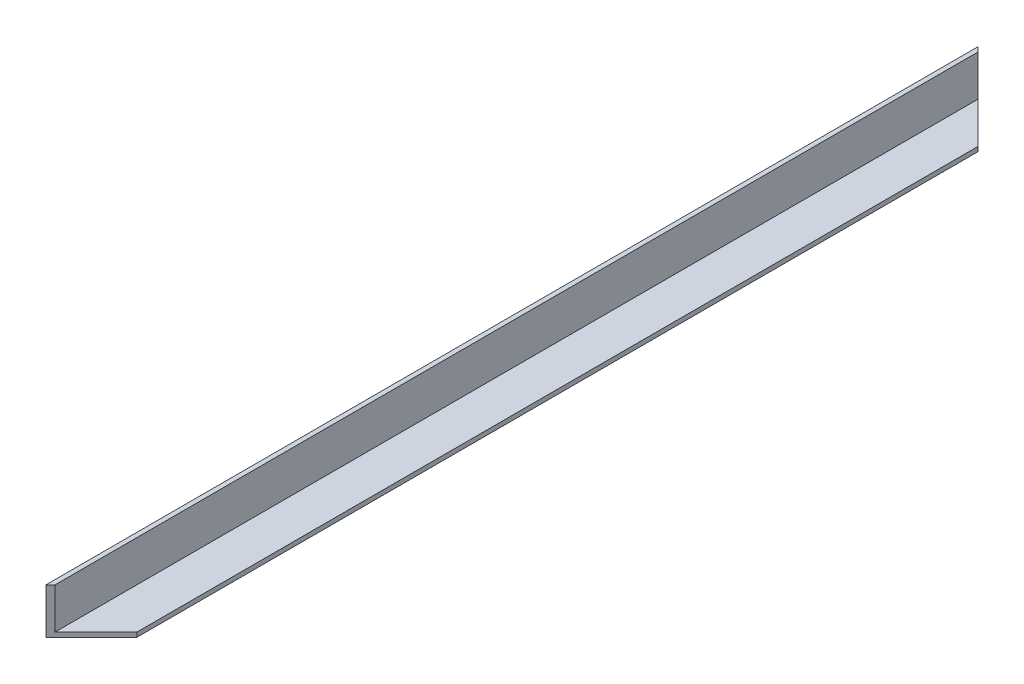
ISO-10303-21;
HEADER;
FILE_DESCRIPTION(('STEP AP214'),'2;1');
FILE_NAME('part.step','',(''),(''),'','','');
FILE_SCHEMA(('AUTOMOTIVE_DESIGN { 1 0 10303 214 1 1 1 1 }'));
ENDSEC;
DATA;
#1=APPLICATION_CONTEXT('core data for automotive mechanical design processes');
#2=APPLICATION_PROTOCOL_DEFINITION('international standard','automotive_design',2000,#1);
#3=PRODUCT_CONTEXT('',#1,'mechanical');
#4=PRODUCT('Part','Part','',(#3));
#5=PRODUCT_RELATED_PRODUCT_CATEGORY('part','',(#4));
#6=PRODUCT_DEFINITION_FORMATION('','',#4);
#7=PRODUCT_DEFINITION_CONTEXT('part definition',#1,'design');
#8=PRODUCT_DEFINITION('design','',#6,#7);
#9=PRODUCT_DEFINITION_SHAPE('','',#8);
#10=(LENGTH_UNIT() NAMED_UNIT(*) SI_UNIT(.MILLI.,.METRE.));
#11=(NAMED_UNIT(*) PLANE_ANGLE_UNIT() SI_UNIT($,.RADIAN.));
#12=(NAMED_UNIT(*) SI_UNIT($,.STERADIAN.) SOLID_ANGLE_UNIT());
#13=UNCERTAINTY_MEASURE_WITH_UNIT(LENGTH_MEASURE(1.E-05),#10,'distance_accuracy_value','');
#14=(GEOMETRIC_REPRESENTATION_CONTEXT(3) GLOBAL_UNCERTAINTY_ASSIGNED_CONTEXT((#13)) GLOBAL_UNIT_ASSIGNED_CONTEXT((#10,
#11,#12)) REPRESENTATION_CONTEXT('',''));
#15=CARTESIAN_POINT('',(0.,0.,0.));
#16=DIRECTION('',(0.,0.,1.));
#17=DIRECTION('',(1.,0.,0.));
#18=AXIS2_PLACEMENT_3D('',#15,#16,#17);
#19=CARTESIAN_POINT('',(2.,20.,410.));
#20=DIRECTION('',(0.,-1.,0.));
#21=DIRECTION('',(0.,0.,-1.));
#22=AXIS2_PLACEMENT_3D('',#19,#20,#21);
#23=PLANE('',#22);
#24=DIRECTION('',(0.,0.,-1.));
#25=VECTOR('',#24,1.);
#26=CARTESIAN_POINT('',(2.,20.,410.));
#27=LINE('',#26,#25);
#28=CARTESIAN_POINT('',(2.,20.,408.));
#29=VERTEX_POINT('',#28);
#30=CARTESIAN_POINT('',(1.99999999999999,20.,1.99999999999995));
#31=VERTEX_POINT('',#30);
#32=EDGE_CURVE('E115',#29,#31,#27,.T.);
#33=ORIENTED_EDGE('',*,*,#32,.T.);
#34=DIRECTION('',(0.707106781186553,0.,0.707106781186542));
#35=VECTOR('',#34,1.);
#36=CARTESIAN_POINT('',(0.,20.,0.));
#37=LINE('',#36,#35);
#38=CARTESIAN_POINT('',(0.,20.,0.));
#39=VERTEX_POINT('',#38);
#40=EDGE_CURVE('E103',#39,#31,#37,.T.);
#41=ORIENTED_EDGE('',*,*,#40,.F.);
#42=DIRECTION('',(0.,0.,-1.));
#43=VECTOR('',#42,1.);
#44=CARTESIAN_POINT('',(0.,20.,410.));
#45=LINE('',#44,#43);
#46=CARTESIAN_POINT('',(0.,20.,410.));
#47=VERTEX_POINT('',#46);
#48=EDGE_CURVE('E11',#47,#39,#45,.T.);
#49=ORIENTED_EDGE('',*,*,#48,.F.);
#50=DIRECTION('',(-0.707106781186541,0.,0.707106781186554));
#51=VECTOR('',#50,1.);
#52=CARTESIAN_POINT('',(0.,20.,410.));
#53=LINE('',#52,#51);
#54=EDGE_CURVE('E50',#29,#47,#53,.T.);
#55=ORIENTED_EDGE('',*,*,#54,.F.);
#56=EDGE_LOOP('',(#33,#41,#49,#55));
#57=FACE_BOUND('',#56,.T.);
#58=ADVANCED_FACE('F36',(#57),#23,.F.);
#59=CARTESIAN_POINT('',(0.,20.,410.));
#60=DIRECTION('',(1.,0.,0.));
#61=DIRECTION('',(0.,1.,0.));
#62=AXIS2_PLACEMENT_3D('',#59,#60,#61);
#63=PLANE('',#62);
#64=DIRECTION('',(0.,-1.,0.));
#65=VECTOR('',#64,1.);
#66=CARTESIAN_POINT('',(0.,20.,0.));
#67=LINE('',#66,#65);
#68=CARTESIAN_POINT('',(0.,0.,0.));
#69=VERTEX_POINT('',#68);
#70=EDGE_CURVE('E119',#39,#69,#67,.T.);
#71=ORIENTED_EDGE('',*,*,#70,.T.);
#72=DIRECTION('',(0.,0.,-1.));
#73=VECTOR('',#72,1.);
#74=CARTESIAN_POINT('',(0.,0.,410.));
#75=LINE('',#74,#73);
#76=CARTESIAN_POINT('',(0.,0.,410.));
#77=VERTEX_POINT('',#76);
#78=EDGE_CURVE('E44',#77,#69,#75,.T.);
#79=ORIENTED_EDGE('',*,*,#78,.F.);
#80=DIRECTION('',(0.,-1.,0.));
#81=VECTOR('',#80,1.);
#82=CARTESIAN_POINT('',(0.,20.,410.));
#83=LINE('',#82,#81);
#84=EDGE_CURVE('E118',#47,#77,#83,.T.);
#85=ORIENTED_EDGE('',*,*,#84,.F.);
#86=ORIENTED_EDGE('',*,*,#48,.T.);
#87=EDGE_LOOP('',(#71,#79,#85,#86));
#88=FACE_BOUND('',#87,.T.);
#89=ADVANCED_FACE('F143',(#88),#63,.F.);
#90=CARTESIAN_POINT('',(0.,0.,410.));
#91=DIRECTION('',(0.,1.,0.));
#92=DIRECTION('',(0.,0.,1.));
#93=AXIS2_PLACEMENT_3D('',#90,#91,#92);
#94=PLANE('',#93);
#95=ORIENTED_EDGE('',*,*,#78,.T.);
#96=DIRECTION('',(0.707106781186553,0.,0.707106781186542));
#97=VECTOR('',#96,1.);
#98=CARTESIAN_POINT('',(0.,0.,0.));
#99=LINE('',#98,#97);
#100=CARTESIAN_POINT('',(20.,0.,19.9999999999997));
#101=VERTEX_POINT('',#100);
#102=EDGE_CURVE('E86',#69,#101,#99,.T.);
#103=ORIENTED_EDGE('',*,*,#102,.T.);
#104=DIRECTION('',(0.,0.,-1.));
#105=VECTOR('',#104,1.);
#106=CARTESIAN_POINT('',(20.,0.,410.));
#107=LINE('',#106,#105);
#108=CARTESIAN_POINT('',(20.,0.,390.));
#109=VERTEX_POINT('',#108);
#110=EDGE_CURVE('E101',#109,#101,#107,.T.);
#111=ORIENTED_EDGE('',*,*,#110,.F.);
#112=DIRECTION('',(-0.707106781186541,0.,0.707106781186554));
#113=VECTOR('',#112,1.);
#114=CARTESIAN_POINT('',(0.,0.,410.));
#115=LINE('',#114,#113);
#116=EDGE_CURVE('E131',#109,#77,#115,.T.);
#117=ORIENTED_EDGE('',*,*,#116,.T.);
#118=EDGE_LOOP('',(#95,#103,#111,#117));
#119=FACE_BOUND('',#118,.T.);
#120=ADVANCED_FACE('F99',(#119),#94,.F.);
#121=CARTESIAN_POINT('',(20.,0.,410.));
#122=DIRECTION('',(-1.,0.,0.));
#123=DIRECTION('',(0.,0.,1.));
#124=AXIS2_PLACEMENT_3D('',#121,#122,#123);
#125=PLANE('',#124);
#126=ORIENTED_EDGE('',*,*,#110,.T.);
#127=DIRECTION('',(0.,1.,0.));
#128=VECTOR('',#127,1.);
#129=CARTESIAN_POINT('',(20.,0.,19.9999999999997));
#130=LINE('',#129,#128);
#131=CARTESIAN_POINT('',(20.,2.,19.9999999999997));
#132=VERTEX_POINT('',#131);
#133=EDGE_CURVE('E83',#101,#132,#130,.T.);
#134=ORIENTED_EDGE('',*,*,#133,.T.);
#135=DIRECTION('',(0.,0.,-1.));
#136=VECTOR('',#135,1.);
#137=CARTESIAN_POINT('',(20.,2.,410.));
#138=LINE('',#137,#136);
#139=CARTESIAN_POINT('',(20.,2.,390.));
#140=VERTEX_POINT('',#139);
#141=EDGE_CURVE('E108',#140,#132,#138,.T.);
#142=ORIENTED_EDGE('',*,*,#141,.F.);
#143=DIRECTION('',(0.,1.,0.));
#144=VECTOR('',#143,1.);
#145=CARTESIAN_POINT('',(20.,0.,390.));
#146=LINE('',#145,#144);
#147=EDGE_CURVE('E107',#109,#140,#146,.T.);
#148=ORIENTED_EDGE('',*,*,#147,.F.);
#149=EDGE_LOOP('',(#126,#134,#142,#148));
#150=FACE_BOUND('',#149,.T.);
#151=ADVANCED_FACE('F106',(#150),#125,.F.);
#152=CARTESIAN_POINT('',(20.,2.,410.));
#153=DIRECTION('',(0.,-1.,0.));
#154=DIRECTION('',(1.,0.,0.));
#155=AXIS2_PLACEMENT_3D('',#152,#153,#154);
#156=PLANE('',#155);
#157=ORIENTED_EDGE('',*,*,#141,.T.);
#158=DIRECTION('',(-0.707106781186553,0.,-0.707106781186542));
#159=VECTOR('',#158,1.);
#160=CARTESIAN_POINT('',(215.,2.00000000000002,214.999999999997));
#161=LINE('',#160,#159);
#162=CARTESIAN_POINT('',(2.,2.,1.99999999999995));
#163=VERTEX_POINT('',#162);
#164=EDGE_CURVE('E89',#132,#163,#161,.T.);
#165=ORIENTED_EDGE('',*,*,#164,.T.);
#166=DIRECTION('',(0.,0.,-1.));
#167=VECTOR('',#166,1.);
#168=CARTESIAN_POINT('',(2.,2.,410.));
#169=LINE('',#168,#167);
#170=CARTESIAN_POINT('',(2.,2.,408.));
#171=VERTEX_POINT('',#170);
#172=EDGE_CURVE('E110',#171,#163,#169,.T.);
#173=ORIENTED_EDGE('',*,*,#172,.F.);
#174=DIRECTION('',(0.707106781186541,0.,-0.707106781186554));
#175=VECTOR('',#174,1.);
#176=CARTESIAN_POINT('',(9.99999999999982,2.,400.));
#177=LINE('',#176,#175);
#178=EDGE_CURVE('E121',#171,#140,#177,.T.);
#179=ORIENTED_EDGE('',*,*,#178,.T.);
#180=EDGE_LOOP('',(#157,#165,#173,#179));
#181=FACE_BOUND('',#180,.T.);
#182=ADVANCED_FACE('F146',(#181),#156,.F.);
#183=CARTESIAN_POINT('',(2.,2.,410.));
#184=DIRECTION('',(-1.,0.,0.));
#185=DIRECTION('',(0.,-1.,0.));
#186=AXIS2_PLACEMENT_3D('',#183,#184,#185);
#187=PLANE('',#186);
#188=ORIENTED_EDGE('',*,*,#172,.T.);
#189=DIRECTION('',(0.,1.,0.));
#190=VECTOR('',#189,1.);
#191=CARTESIAN_POINT('',(2.,2.00000000000004,1.99999999999995));
#192=LINE('',#191,#190);
#193=EDGE_CURVE('E94',#163,#31,#192,.T.);
#194=ORIENTED_EDGE('',*,*,#193,.T.);
#195=ORIENTED_EDGE('',*,*,#32,.F.);
#196=DIRECTION('',(0.,-1.,0.));
#197=VECTOR('',#196,1.);
#198=CARTESIAN_POINT('',(2.,2.,408.));
#199=LINE('',#198,#197);
#200=EDGE_CURVE('E125',#29,#171,#199,.T.);
#201=ORIENTED_EDGE('',*,*,#200,.T.);
#202=EDGE_LOOP('',(#188,#194,#195,#201));
#203=FACE_BOUND('',#202,.T.);
#204=ADVANCED_FACE('F140',(#203),#187,.F.);
#205=CARTESIAN_POINT('',(0.,0.,0.));
#206=DIRECTION('',(-0.707106781186542,0.,0.707106781186553));
#207=DIRECTION('',(0.707106781186553,0.,0.707106781186542));
#208=AXIS2_PLACEMENT_3D('',#205,#206,#207);
#209=PLANE('',#208);
#210=ORIENTED_EDGE('',*,*,#133,.F.);
#211=ORIENTED_EDGE('',*,*,#102,.F.);
#212=ORIENTED_EDGE('',*,*,#70,.F.);
#213=ORIENTED_EDGE('',*,*,#40,.T.);
#214=ORIENTED_EDGE('',*,*,#193,.F.);
#215=ORIENTED_EDGE('',*,*,#164,.F.);
#216=EDGE_LOOP('',(#210,#211,#212,#213,#214,#215));
#217=FACE_BOUND('',#216,.T.);
#218=ADVANCED_FACE('F85',(#217),#209,.F.);
#219=CARTESIAN_POINT('',(0.,0.,410.));
#220=DIRECTION('',(-0.707106781186554,0.,-0.707106781186541));
#221=DIRECTION('',(-0.707106781186541,0.,0.707106781186554));
#222=AXIS2_PLACEMENT_3D('',#219,#220,#221);
#223=PLANE('',#222);
#224=ORIENTED_EDGE('',*,*,#200,.F.);
#225=ORIENTED_EDGE('',*,*,#54,.T.);
#226=ORIENTED_EDGE('',*,*,#84,.T.);
#227=ORIENTED_EDGE('',*,*,#116,.F.);
#228=ORIENTED_EDGE('',*,*,#147,.T.);
#229=ORIENTED_EDGE('',*,*,#178,.F.);
#230=EDGE_LOOP('',(#224,#225,#226,#227,#228,#229));
#231=FACE_BOUND('',#230,.T.);
#232=ADVANCED_FACE('F144',(#231),#223,.F.);
#233=CLOSED_SHELL('',(#58,#89,#120,#151,#182,#204,#218,#232));
#234=MANIFOLD_SOLID_BREP('B2',#233);
#235=ADVANCED_BREP_SHAPE_REPRESENTATION('',(#18,#234),#14);
#236=SHAPE_DEFINITION_REPRESENTATION(#9,#235);
ENDSEC;
END-ISO-10303-21;
